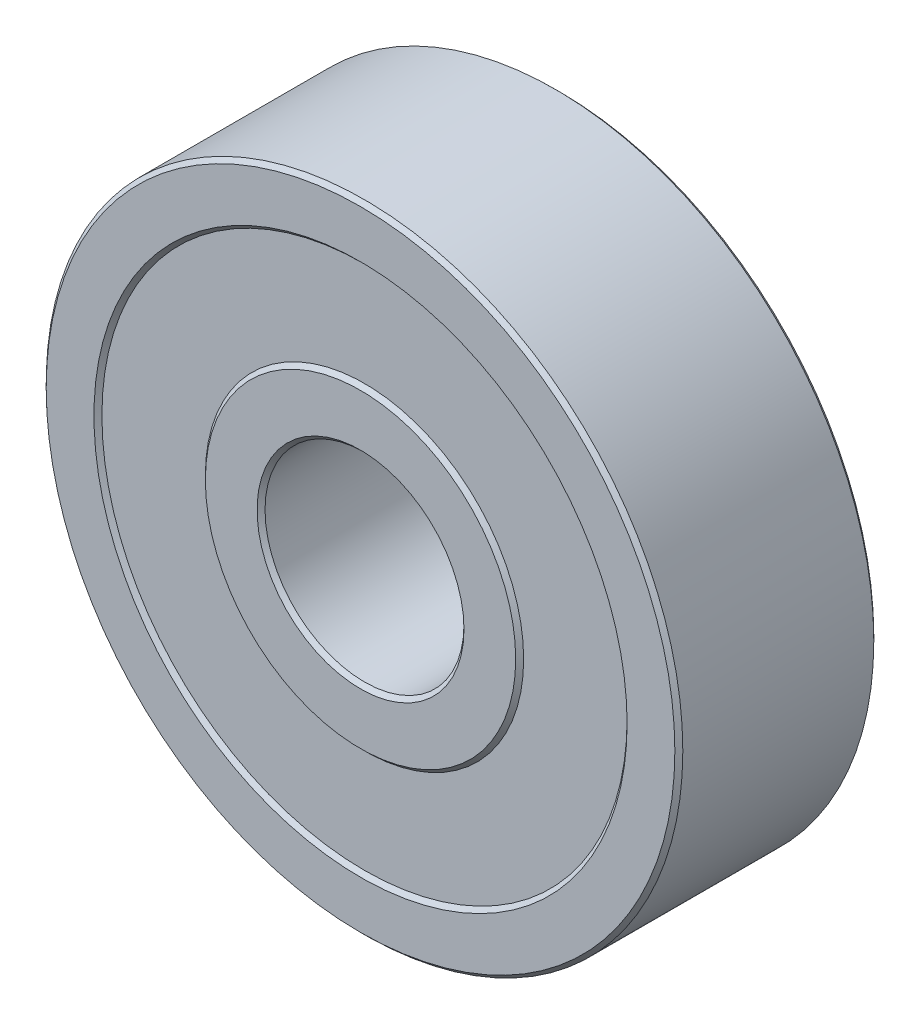
ISO-10303-21;
HEADER;
FILE_DESCRIPTION(('STEP AP214'),'2;1');
FILE_NAME('part.step','',(''),(''),'','','');
FILE_SCHEMA(('AUTOMOTIVE_DESIGN { 1 0 10303 214 1 1 1 1 }'));
ENDSEC;
DATA;
#1=APPLICATION_CONTEXT('core data for automotive mechanical design processes');
#2=APPLICATION_PROTOCOL_DEFINITION('international standard','automotive_design',2000,#1);
#3=PRODUCT_CONTEXT('',#1,'mechanical');
#4=PRODUCT('Part','Part','',(#3));
#5=PRODUCT_RELATED_PRODUCT_CATEGORY('part','',(#4));
#6=PRODUCT_DEFINITION_FORMATION('','',#4);
#7=PRODUCT_DEFINITION_CONTEXT('part definition',#1,'design');
#8=PRODUCT_DEFINITION('design','',#6,#7);
#9=PRODUCT_DEFINITION_SHAPE('','',#8);
#10=(LENGTH_UNIT() NAMED_UNIT(*) SI_UNIT(.MILLI.,.METRE.));
#11=(NAMED_UNIT(*) PLANE_ANGLE_UNIT() SI_UNIT($,.RADIAN.));
#12=(NAMED_UNIT(*) SI_UNIT($,.STERADIAN.) SOLID_ANGLE_UNIT());
#13=UNCERTAINTY_MEASURE_WITH_UNIT(LENGTH_MEASURE(1.E-05),#10,'distance_accuracy_value','');
#14=(GEOMETRIC_REPRESENTATION_CONTEXT(3) GLOBAL_UNCERTAINTY_ASSIGNED_CONTEXT((#13)) GLOBAL_UNIT_ASSIGNED_CONTEXT((#10,
#11,#12)) REPRESENTATION_CONTEXT('',''));
#15=CARTESIAN_POINT('',(0.,0.,0.));
#16=DIRECTION('',(0.,0.,1.));
#17=DIRECTION('',(1.,0.,0.));
#18=AXIS2_PLACEMENT_3D('',#15,#16,#17);
#19=CARTESIAN_POINT('',(0.,0.,-2.5));
#20=DIRECTION('',(0.,0.,1.));
#21=DIRECTION('',(1.,0.,0.));
#22=AXIS2_PLACEMENT_3D('',#19,#20,#21);
#23=PLANE('',#22);
#24=CARTESIAN_POINT('',(0.,0.,-2.5));
#25=DIRECTION('',(0.,0.,1.));
#26=DIRECTION('',(1.,0.,0.));
#27=AXIS2_PLACEMENT_3D('',#24,#25,#26);
#28=CIRCLE('',#27,7.9);
#29=CARTESIAN_POINT('',(7.9,0.,-2.5));
#30=VERTEX_POINT('',#29);
#31=EDGE_CURVE('E78',#30,#30,#28,.F.);
#32=ORIENTED_EDGE('',*,*,#31,.T.);
#33=EDGE_LOOP('',(#32));
#34=FACE_BOUND('',#33,.T.);
#35=CARTESIAN_POINT('',(0.,0.,-2.5));
#36=DIRECTION('',(0.,0.,1.));
#37=DIRECTION('',(1.,0.,0.));
#38=AXIS2_PLACEMENT_3D('',#35,#36,#37);
#39=CIRCLE('',#38,6.7);
#40=CARTESIAN_POINT('',(6.7,0.,-2.5));
#41=VERTEX_POINT('',#40);
#42=EDGE_CURVE('E82',#41,#41,#39,.T.);
#43=ORIENTED_EDGE('',*,*,#42,.T.);
#44=EDGE_LOOP('',(#43));
#45=FACE_BOUND('',#44,.T.);
#46=ADVANCED_FACE('F47',(#34,#45),#23,.F.);
#47=CARTESIAN_POINT('',(0.,0.,2.5));
#48=DIRECTION('',(0.,0.,1.));
#49=DIRECTION('',(1.,0.,0.));
#50=AXIS2_PLACEMENT_3D('',#47,#48,#49);
#51=PLANE('',#50);
#52=CARTESIAN_POINT('',(0.,0.,2.5));
#53=DIRECTION('',(0.,0.,1.));
#54=DIRECTION('',(1.,0.,0.));
#55=AXIS2_PLACEMENT_3D('',#52,#53,#54);
#56=CIRCLE('',#55,6.7);
#57=CARTESIAN_POINT('',(6.7,0.,2.5));
#58=VERTEX_POINT('',#57);
#59=EDGE_CURVE('E101',#58,#58,#56,.F.);
#60=ORIENTED_EDGE('',*,*,#59,.T.);
#61=EDGE_LOOP('',(#60));
#62=FACE_BOUND('',#61,.T.);
#63=CARTESIAN_POINT('',(0.,0.,2.5));
#64=DIRECTION('',(0.,0.,1.));
#65=DIRECTION('',(1.,0.,0.));
#66=AXIS2_PLACEMENT_3D('',#63,#64,#65);
#67=CIRCLE('',#66,7.9);
#68=CARTESIAN_POINT('',(7.9,0.,2.5));
#69=VERTEX_POINT('',#68);
#70=EDGE_CURVE('E105',#69,#69,#67,.T.);
#71=ORIENTED_EDGE('',*,*,#70,.T.);
#72=EDGE_LOOP('',(#71));
#73=FACE_BOUND('',#72,.T.);
#74=ADVANCED_FACE('F142',(#62,#73),#51,.T.);
#75=CARTESIAN_POINT('',(0.,0.,2.5));
#76=DIRECTION('',(0.,0.,-1.));
#77=DIRECTION('',(-1.,0.,0.));
#78=AXIS2_PLACEMENT_3D('',#75,#76,#77);
#79=CYLINDRICAL_SURFACE('',#78,8.);
#80=CARTESIAN_POINT('',(0.,0.,-2.4));
#81=DIRECTION('',(0.,0.,1.));
#82=DIRECTION('',(1.,0.,0.));
#83=AXIS2_PLACEMENT_3D('',#80,#81,#82);
#84=CIRCLE('',#83,8.);
#85=CARTESIAN_POINT('',(8.,0.,-2.4));
#86=VERTEX_POINT('',#85);
#87=EDGE_CURVE('E86',#86,#86,#84,.T.);
#88=ORIENTED_EDGE('',*,*,#87,.T.);
#89=EDGE_LOOP('',(#88));
#90=FACE_BOUND('',#89,.T.);
#91=CARTESIAN_POINT('',(0.,0.,2.4));
#92=DIRECTION('',(0.,0.,1.));
#93=DIRECTION('',(1.,0.,0.));
#94=AXIS2_PLACEMENT_3D('',#91,#92,#93);
#95=CIRCLE('',#94,8.);
#96=CARTESIAN_POINT('',(8.,0.,2.4));
#97=VERTEX_POINT('',#96);
#98=EDGE_CURVE('E90',#97,#97,#95,.F.);
#99=ORIENTED_EDGE('',*,*,#98,.T.);
#100=EDGE_LOOP('',(#99));
#101=FACE_BOUND('',#100,.T.);
#102=ADVANCED_FACE('F132',(#90,#101),#79,.T.);
#103=CARTESIAN_POINT('',(6.6,0.,-2.4));
#104=DIRECTION('',(0.,0.,-1.));
#105=DIRECTION('',(-1.,0.,0.));
#106=AXIS2_PLACEMENT_3D('',#103,#104,#105);
#107=PLANE('',#106);
#108=CARTESIAN_POINT('',(0.,0.,-2.4));
#109=DIRECTION('',(0.,0.,-1.));
#110=DIRECTION('',(-1.,0.,0.));
#111=AXIS2_PLACEMENT_3D('',#108,#109,#110);
#112=CIRCLE('',#111,6.6);
#113=CARTESIAN_POINT('',(-6.6,0.,-2.4));
#114=VERTEX_POINT('',#113);
#115=EDGE_CURVE('E109',#114,#114,#112,.T.);
#116=ORIENTED_EDGE('',*,*,#115,.T.);
#117=EDGE_LOOP('',(#116));
#118=FACE_BOUND('',#117,.T.);
#119=CARTESIAN_POINT('',(0.,0.,-2.4));
#120=DIRECTION('',(0.,0.,-1.));
#121=DIRECTION('',(-1.,0.,0.));
#122=AXIS2_PLACEMENT_3D('',#119,#120,#121);
#123=CIRCLE('',#122,4.);
#124=CARTESIAN_POINT('',(-4.,0.,-2.4));
#125=VERTEX_POINT('',#124);
#126=EDGE_CURVE('E114',#125,#125,#123,.T.);
#127=ORIENTED_EDGE('',*,*,#126,.F.);
#128=EDGE_LOOP('',(#127));
#129=FACE_BOUND('',#128,.T.);
#130=ADVANCED_FACE('F129',(#118,#129),#107,.T.);
#131=CARTESIAN_POINT('',(6.6,0.,2.4));
#132=DIRECTION('',(0.,0.,1.));
#133=DIRECTION('',(1.,0.,0.));
#134=AXIS2_PLACEMENT_3D('',#131,#132,#133);
#135=PLANE('',#134);
#136=CARTESIAN_POINT('',(0.,0.,2.4));
#137=DIRECTION('',(0.,0.,-1.));
#138=DIRECTION('',(-1.,0.,0.));
#139=AXIS2_PLACEMENT_3D('',#136,#137,#138);
#140=CIRCLE('',#139,4.);
#141=CARTESIAN_POINT('',(-4.,0.,2.4));
#142=VERTEX_POINT('',#141);
#143=EDGE_CURVE('E115',#142,#142,#140,.T.);
#144=ORIENTED_EDGE('',*,*,#143,.T.);
#145=EDGE_LOOP('',(#144));
#146=FACE_BOUND('',#145,.T.);
#147=CARTESIAN_POINT('',(0.,0.,2.4));
#148=DIRECTION('',(0.,0.,-1.));
#149=DIRECTION('',(-1.,0.,0.));
#150=AXIS2_PLACEMENT_3D('',#147,#148,#149);
#151=CIRCLE('',#150,6.6);
#152=CARTESIAN_POINT('',(-6.6,0.,2.4));
#153=VERTEX_POINT('',#152);
#154=EDGE_CURVE('E110',#153,#153,#151,.T.);
#155=ORIENTED_EDGE('',*,*,#154,.F.);
#156=EDGE_LOOP('',(#155));
#157=FACE_BOUND('',#156,.T.);
#158=ADVANCED_FACE('F131',(#146,#157),#135,.T.);
#159=CARTESIAN_POINT('',(0.,0.,2.5));
#160=DIRECTION('',(0.,0.,1.));
#161=DIRECTION('',(1.,0.,0.));
#162=AXIS2_PLACEMENT_3D('',#159,#160,#161);
#163=CIRCLE('',#162,3.9);
#164=CARTESIAN_POINT('',(3.9,0.,2.5));
#165=VERTEX_POINT('',#164);
#166=EDGE_CURVE('E94',#165,#165,#163,.T.);
#167=ORIENTED_EDGE('',*,*,#166,.T.);
#168=EDGE_LOOP('',(#167));
#169=FACE_BOUND('',#168,.T.);
#170=CARTESIAN_POINT('',(0.,0.,2.5));
#171=DIRECTION('',(0.,0.,1.));
#172=DIRECTION('',(1.,0.,0.));
#173=AXIS2_PLACEMENT_3D('',#170,#171,#172);
#174=CIRCLE('',#173,2.6);
#175=CARTESIAN_POINT('',(2.6,0.,2.5));
#176=VERTEX_POINT('',#175);
#177=EDGE_CURVE('E97',#176,#176,#174,.F.);
#178=ORIENTED_EDGE('',*,*,#177,.T.);
#179=EDGE_LOOP('',(#178));
#180=FACE_BOUND('',#179,.T.);
#181=ADVANCED_FACE('F138',(#169,#180),#51,.T.);
#182=CARTESIAN_POINT('',(0.,0.,2.5));
#183=DIRECTION('',(0.,0.,-1.));
#184=DIRECTION('',(-1.,0.,0.));
#185=AXIS2_PLACEMENT_3D('',#182,#183,#184);
#186=CYLINDRICAL_SURFACE('',#185,2.5);
#187=CARTESIAN_POINT('',(0.,0.,-2.4));
#188=DIRECTION('',(0.,0.,1.));
#189=DIRECTION('',(1.,0.,0.));
#190=AXIS2_PLACEMENT_3D('',#187,#188,#189);
#191=CIRCLE('',#190,2.5);
#192=CARTESIAN_POINT('',(-2.5,0.,-2.4));
#193=VERTEX_POINT('',#192);
#194=EDGE_CURVE('E10',#193,#193,#191,.F.);
#195=ORIENTED_EDGE('',*,*,#194,.T.);
#196=EDGE_LOOP('',(#195));
#197=FACE_BOUND('',#196,.T.);
#198=CARTESIAN_POINT('',(0.,0.,2.4));
#199=DIRECTION('',(0.,0.,1.));
#200=DIRECTION('',(1.,0.,0.));
#201=AXIS2_PLACEMENT_3D('',#198,#199,#200);
#202=CIRCLE('',#201,2.5);
#203=CARTESIAN_POINT('',(2.5,0.,2.4));
#204=VERTEX_POINT('',#203);
#205=EDGE_CURVE('E56',#204,#204,#202,.T.);
#206=ORIENTED_EDGE('',*,*,#205,.T.);
#207=EDGE_LOOP('',(#206));
#208=FACE_BOUND('',#207,.T.);
#209=ADVANCED_FACE('F156',(#197,#208),#186,.F.);
#210=CARTESIAN_POINT('',(0.,0.,-2.5));
#211=DIRECTION('',(0.,0.,1.));
#212=DIRECTION('',(1.,0.,0.));
#213=AXIS2_PLACEMENT_3D('',#210,#211,#212);
#214=CIRCLE('',#213,2.6);
#215=CARTESIAN_POINT('',(-2.6,0.,-2.5));
#216=VERTEX_POINT('',#215);
#217=EDGE_CURVE('E64',#216,#216,#214,.T.);
#218=ORIENTED_EDGE('',*,*,#217,.T.);
#219=EDGE_LOOP('',(#218));
#220=FACE_BOUND('',#219,.T.);
#221=CARTESIAN_POINT('',(0.,0.,-2.5));
#222=DIRECTION('',(0.,0.,1.));
#223=DIRECTION('',(1.,0.,0.));
#224=AXIS2_PLACEMENT_3D('',#221,#222,#223);
#225=CIRCLE('',#224,3.9);
#226=CARTESIAN_POINT('',(3.9,0.,-2.5));
#227=VERTEX_POINT('',#226);
#228=EDGE_CURVE('E72',#227,#227,#225,.F.);
#229=ORIENTED_EDGE('',*,*,#228,.T.);
#230=EDGE_LOOP('',(#229));
#231=FACE_BOUND('',#230,.T.);
#232=ADVANCED_FACE('F148',(#220,#231),#23,.F.);
#233=CARTESIAN_POINT('',(0.,0.,2.5));
#234=DIRECTION('',(0.,0.,1.));
#235=DIRECTION('',(1.,0.,0.));
#236=AXIS2_PLACEMENT_3D('',#233,#234,#235);
#237=CONICAL_SURFACE('',#236,6.7,0.785398163397435);
#238=ORIENTED_EDGE('',*,*,#154,.T.);
#239=EDGE_LOOP('',(#238));
#240=FACE_BOUND('',#239,.T.);
#241=ORIENTED_EDGE('',*,*,#59,.F.);
#242=EDGE_LOOP('',(#241));
#243=FACE_BOUND('',#242,.T.);
#244=ADVANCED_FACE('F155',(#240,#243),#237,.F.);
#245=CARTESIAN_POINT('',(0.,0.,2.4));
#246=DIRECTION('',(0.,0.,-1.));
#247=DIRECTION('',(-1.,0.,0.));
#248=AXIS2_PLACEMENT_3D('',#245,#246,#247);
#249=CONICAL_SURFACE('',#248,4.,0.785398163397453);
#250=ORIENTED_EDGE('',*,*,#166,.F.);
#251=EDGE_LOOP('',(#250));
#252=FACE_BOUND('',#251,.T.);
#253=ORIENTED_EDGE('',*,*,#143,.F.);
#254=EDGE_LOOP('',(#253));
#255=FACE_BOUND('',#254,.T.);
#256=ADVANCED_FACE('F161',(#252,#255),#249,.T.);
#257=CARTESIAN_POINT('',(0.,0.,-2.4));
#258=DIRECTION('',(0.,0.,1.));
#259=DIRECTION('',(1.,0.,0.));
#260=AXIS2_PLACEMENT_3D('',#257,#258,#259);
#261=CONICAL_SURFACE('',#260,8.,0.785398163397457);
#262=ORIENTED_EDGE('',*,*,#31,.F.);
#263=EDGE_LOOP('',(#262));
#264=FACE_BOUND('',#263,.T.);
#265=ORIENTED_EDGE('',*,*,#87,.F.);
#266=EDGE_LOOP('',(#265));
#267=FACE_BOUND('',#266,.T.);
#268=ADVANCED_FACE('F200',(#264,#267),#261,.T.);
#269=CARTESIAN_POINT('',(0.,0.,2.5));
#270=DIRECTION('',(0.,0.,-1.));
#271=DIRECTION('',(-1.,0.,0.));
#272=AXIS2_PLACEMENT_3D('',#269,#270,#271);
#273=CONICAL_SURFACE('',#272,7.9,0.785398163397448);
#274=ORIENTED_EDGE('',*,*,#98,.F.);
#275=EDGE_LOOP('',(#274));
#276=FACE_BOUND('',#275,.T.);
#277=ORIENTED_EDGE('',*,*,#70,.F.);
#278=EDGE_LOOP('',(#277));
#279=FACE_BOUND('',#278,.T.);
#280=ADVANCED_FACE('F193',(#276,#279),#273,.T.);
#281=CARTESIAN_POINT('',(0.,0.,-2.5));
#282=DIRECTION('',(0.,0.,-1.));
#283=DIRECTION('',(-1.,0.,0.));
#284=AXIS2_PLACEMENT_3D('',#281,#282,#283);
#285=CONICAL_SURFACE('',#284,2.6,0.785398163397446);
#286=CARTESIAN_POINT('',(-2.5,0.,-2.4));
#287=CARTESIAN_POINT('',(-2.50104166666667,0.,-2.40104166666667));
#288=CARTESIAN_POINT('',(-2.50208333333333,0.,-2.40208333333334));
#289=CARTESIAN_POINT('',(-2.50416666666667,0.,-2.40416666666667));
#290=CARTESIAN_POINT('',(-2.50520833333333,0.,-2.40520833333334));
#291=CARTESIAN_POINT('',(-2.50729166666667,0.,-2.40729166666667));
#292=CARTESIAN_POINT('',(-2.50833333333333,0.,-2.40833333333334));
#293=CARTESIAN_POINT('',(-2.51041666666667,0.,-2.41041666666667));
#294=CARTESIAN_POINT('',(-2.51145833333333,0.,-2.41145833333334));
#295=CARTESIAN_POINT('',(-2.51354166666667,0.,-2.41354166666667));
#296=CARTESIAN_POINT('',(-2.51458333333333,0.,-2.41458333333334));
#297=CARTESIAN_POINT('',(-2.51666666666667,0.,-2.41666666666667));
#298=CARTESIAN_POINT('',(-2.51770833333333,0.,-2.41770833333334));
#299=CARTESIAN_POINT('',(-2.51979166666667,0.,-2.41979166666667));
#300=CARTESIAN_POINT('',(-2.52083333333333,0.,-2.42083333333334));
#301=CARTESIAN_POINT('',(-2.52291666666667,0.,-2.42291666666667));
#302=CARTESIAN_POINT('',(-2.52395833333333,0.,-2.42395833333334));
#303=CARTESIAN_POINT('',(-2.52604166666667,0.,-2.42604166666667));
#304=CARTESIAN_POINT('',(-2.52708333333333,0.,-2.42708333333334));
#305=CARTESIAN_POINT('',(-2.52916666666667,0.,-2.42916666666667));
#306=CARTESIAN_POINT('',(-2.53020833333333,0.,-2.43020833333334));
#307=CARTESIAN_POINT('',(-2.53229166666667,0.,-2.43229166666667));
#308=CARTESIAN_POINT('',(-2.53333333333333,0.,-2.43333333333334));
#309=CARTESIAN_POINT('',(-2.53541666666667,0.,-2.43541666666667));
#310=CARTESIAN_POINT('',(-2.53645833333333,0.,-2.43645833333334));
#311=CARTESIAN_POINT('',(-2.53854166666667,0.,-2.43854166666667));
#312=CARTESIAN_POINT('',(-2.53958333333333,0.,-2.43958333333334));
#313=CARTESIAN_POINT('',(-2.54166666666667,0.,-2.44166666666667));
#314=CARTESIAN_POINT('',(-2.54270833333333,0.,-2.44270833333334));
#315=CARTESIAN_POINT('',(-2.54479166666667,0.,-2.44479166666667));
#316=CARTESIAN_POINT('',(-2.54583333333333,0.,-2.44583333333334));
#317=CARTESIAN_POINT('',(-2.54791666666666,0.,-2.44791666666667));
#318=CARTESIAN_POINT('',(-2.54895833333333,0.,-2.44895833333333));
#319=CARTESIAN_POINT('',(-2.55104166666667,0.,-2.45104166666667));
#320=CARTESIAN_POINT('',(-2.55208333333333,0.,-2.45208333333333));
#321=CARTESIAN_POINT('',(-2.55416666666666,0.,-2.45416666666667));
#322=CARTESIAN_POINT('',(-2.55520833333333,0.,-2.45520833333334));
#323=CARTESIAN_POINT('',(-2.55729166666666,0.,-2.45729166666667));
#324=CARTESIAN_POINT('',(-2.55833333333333,0.,-2.45833333333333));
#325=CARTESIAN_POINT('',(-2.56041666666667,0.,-2.46041666666667));
#326=CARTESIAN_POINT('',(-2.56145833333333,0.,-2.46145833333334));
#327=CARTESIAN_POINT('',(-2.56354166666666,0.,-2.46354166666667));
#328=CARTESIAN_POINT('',(-2.56458333333333,0.,-2.46458333333333));
#329=CARTESIAN_POINT('',(-2.56666666666666,0.,-2.46666666666667));
#330=CARTESIAN_POINT('',(-2.56770833333333,0.,-2.46770833333333));
#331=CARTESIAN_POINT('',(-2.56979166666666,0.,-2.46979166666667));
#332=CARTESIAN_POINT('',(-2.57083333333333,0.,-2.47083333333333));
#333=CARTESIAN_POINT('',(-2.57291666666666,0.,-2.47291666666667));
#334=CARTESIAN_POINT('',(-2.57395833333333,0.,-2.47395833333333));
#335=CARTESIAN_POINT('',(-2.57604166666666,0.,-2.47604166666667));
#336=CARTESIAN_POINT('',(-2.57708333333333,0.,-2.47708333333333));
#337=CARTESIAN_POINT('',(-2.57916666666666,0.,-2.47916666666667));
#338=CARTESIAN_POINT('',(-2.58020833333333,0.,-2.48020833333333));
#339=CARTESIAN_POINT('',(-2.58229166666666,0.,-2.48229166666667));
#340=CARTESIAN_POINT('',(-2.58333333333333,0.,-2.48333333333333));
#341=CARTESIAN_POINT('',(-2.58541666666666,0.,-2.48541666666667));
#342=CARTESIAN_POINT('',(-2.58645833333333,0.,-2.48645833333333));
#343=CARTESIAN_POINT('',(-2.58854166666666,0.,-2.48854166666667));
#344=CARTESIAN_POINT('',(-2.58958333333333,0.,-2.48958333333333));
#345=CARTESIAN_POINT('',(-2.59166666666666,0.,-2.49166666666667));
#346=CARTESIAN_POINT('',(-2.59270833333333,0.,-2.49270833333333));
#347=CARTESIAN_POINT('',(-2.59479166666666,0.,-2.49479166666667));
#348=CARTESIAN_POINT('',(-2.59583333333333,0.,-2.49583333333333));
#349=CARTESIAN_POINT('',(-2.59791666666666,0.,-2.49791666666667));
#350=CARTESIAN_POINT('',(-2.59895833333333,0.,-2.49895833333333));
#351=CARTESIAN_POINT('',(-2.6,0.,-2.5));
#352=B_SPLINE_CURVE_WITH_KNOTS('',3,(#286,#287,#288,#289,#290,#291,#292,#293,#294,#295,#296,
#297,#298,#299,#300,#301,#302,#303,#304,#305,#306,#307,#308,#309,#310,#311,#312,#313,#314,#315,
#316,#317,#318,#319,#320,#321,#322,#323,#324,#325,#326,#327,#328,#329,#330,#331,#332,#333,#334,
#335,#336,#337,#338,#339,#340,#341,#342,#343,#344,#345,#346,#347,#348,#349,#350,#351),
.UNSPECIFIED.,.F.,.F.,(4,2,2,2,2,2,2,2,2,2,2,2,2,2,2,2,2,2,2,2,2,2,2,2,2,2,2,2,2,2,2,2,4),(0.,
0.00441941738241605,0.0088388347648321,0.0132582521472475,0.0176776695296636,0.022097086912079,
0.0265165042944951,0.0309359216769105,0.0353553390593266,0.0397747564417423,0.044194173824158,
0.0486135912065738,0.0530330085889895,0.0574524259714052,0.061871843353821,0.0662912607362367,
0.0707106781186525,0.0751300955010685,0.0795495128834842,0.0839689302659,0.0883883476483157,
0.0928077650307315,0.0972271824131472,0.101646599795563,0.106066017177979,0.110485434560395,
0.11490485194281,0.119324269325226,0.123743686707642,0.128163104090058,0.132582521472473,
0.137001938854889,0.141421356237305),.UNSPECIFIED.);
#353=EDGE_CURVE('BSEAM177',#193,#216,#352,.T.);
#354=ORIENTED_EDGE('',*,*,#194,.F.);
#355=ORIENTED_EDGE('',*,*,#217,.F.);
#356=ORIENTED_EDGE('',*,*,#353,.T.);
#357=ORIENTED_EDGE('',*,*,#353,.F.);
#358=EDGE_LOOP('',(#354,#356,#355,#357));
#359=FACE_BOUND('',#358,.T.);
#360=ADVANCED_FACE('F177',(#359),#285,.F.);
#361=CARTESIAN_POINT('',(0.,0.,2.4));
#362=DIRECTION('',(0.,0.,1.));
#363=DIRECTION('',(1.,0.,0.));
#364=AXIS2_PLACEMENT_3D('',#361,#362,#363);
#365=CONICAL_SURFACE('',#364,2.5,0.78539816339745);
#366=ORIENTED_EDGE('',*,*,#177,.F.);
#367=EDGE_LOOP('',(#366));
#368=FACE_BOUND('',#367,.T.);
#369=ORIENTED_EDGE('',*,*,#205,.F.);
#370=EDGE_LOOP('',(#369));
#371=FACE_BOUND('',#370,.T.);
#372=ADVANCED_FACE('F170',(#368,#371),#365,.F.);
#373=CARTESIAN_POINT('',(0.,0.,-2.5));
#374=DIRECTION('',(0.,0.,1.));
#375=DIRECTION('',(1.,0.,0.));
#376=AXIS2_PLACEMENT_3D('',#373,#374,#375);
#377=CONICAL_SURFACE('',#376,3.9,0.785398163397448);
#378=ORIENTED_EDGE('',*,*,#126,.T.);
#379=EDGE_LOOP('',(#378));
#380=FACE_BOUND('',#379,.T.);
#381=ORIENTED_EDGE('',*,*,#228,.F.);
#382=EDGE_LOOP('',(#381));
#383=FACE_BOUND('',#382,.T.);
#384=ADVANCED_FACE('F126',(#380,#383),#377,.T.);
#385=CARTESIAN_POINT('',(0.,0.,-2.4));
#386=DIRECTION('',(0.,0.,-1.));
#387=DIRECTION('',(-1.,0.,0.));
#388=AXIS2_PLACEMENT_3D('',#385,#386,#387);
#389=CONICAL_SURFACE('',#388,6.6,0.785398163397444);
#390=ORIENTED_EDGE('',*,*,#42,.F.);
#391=EDGE_LOOP('',(#390));
#392=FACE_BOUND('',#391,.T.);
#393=ORIENTED_EDGE('',*,*,#115,.F.);
#394=EDGE_LOOP('',(#393));
#395=FACE_BOUND('',#394,.T.);
#396=ADVANCED_FACE('F50',(#392,#395),#389,.F.);
#397=CLOSED_SHELL('',(#46,#74,#102,#130,#158,#181,#209,#232,#244,#256,#268,#280,#360,#372,#384,#396));
#398=MANIFOLD_SOLID_BREP('B2',#397);
#399=ADVANCED_BREP_SHAPE_REPRESENTATION('',(#18,#398),#14);
#400=SHAPE_DEFINITION_REPRESENTATION(#9,#399);
ENDSEC;
END-ISO-10303-21;
